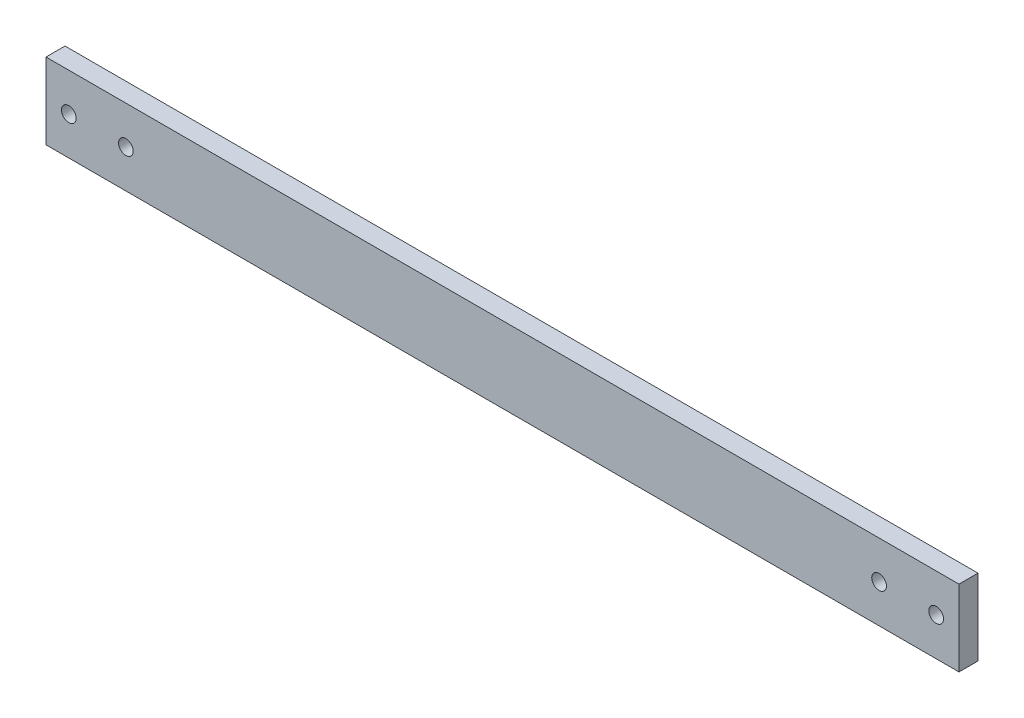
ISO-10303-21;
HEADER;
FILE_DESCRIPTION(('STEP AP214'),'2;1');
FILE_NAME('part.step','',(''),(''),'','','');
FILE_SCHEMA(('AUTOMOTIVE_DESIGN { 1 0 10303 214 1 1 1 1 }'));
ENDSEC;
DATA;
#1=APPLICATION_CONTEXT('core data for automotive mechanical design processes');
#2=APPLICATION_PROTOCOL_DEFINITION('international standard','automotive_design',2000,#1);
#3=PRODUCT_CONTEXT('',#1,'mechanical');
#4=PRODUCT('Part','Part','',(#3));
#5=PRODUCT_RELATED_PRODUCT_CATEGORY('part','',(#4));
#6=PRODUCT_DEFINITION_FORMATION('','',#4);
#7=PRODUCT_DEFINITION_CONTEXT('part definition',#1,'design');
#8=PRODUCT_DEFINITION('design','',#6,#7);
#9=PRODUCT_DEFINITION_SHAPE('','',#8);
#10=(LENGTH_UNIT() NAMED_UNIT(*) SI_UNIT(.MILLI.,.METRE.));
#11=(NAMED_UNIT(*) PLANE_ANGLE_UNIT() SI_UNIT($,.RADIAN.));
#12=(NAMED_UNIT(*) SI_UNIT($,.STERADIAN.) SOLID_ANGLE_UNIT());
#13=UNCERTAINTY_MEASURE_WITH_UNIT(LENGTH_MEASURE(1.E-05),#10,'distance_accuracy_value','');
#14=(GEOMETRIC_REPRESENTATION_CONTEXT(3) GLOBAL_UNCERTAINTY_ASSIGNED_CONTEXT((#13)) GLOBAL_UNIT_ASSIGNED_CONTEXT((#10,
#11,#12)) REPRESENTATION_CONTEXT('',''));
#15=CARTESIAN_POINT('',(0.,0.,0.));
#16=DIRECTION('',(0.,0.,1.));
#17=DIRECTION('',(1.,0.,0.));
#18=AXIS2_PLACEMENT_3D('',#15,#16,#17);
#19=CARTESIAN_POINT('',(0.,12.7,3.175));
#20=DIRECTION('',(0.999999999999999,0.,0.));
#21=DIRECTION('',(0.,1.,0.));
#22=AXIS2_PLACEMENT_3D('',#19,#20,#21);
#23=PLANE('',#22);
#24=DIRECTION('',(0.,-1.,0.));
#25=VECTOR('',#24,1.);
#26=CARTESIAN_POINT('',(0.,12.7,-3.175));
#27=LINE('',#26,#25);
#28=CARTESIAN_POINT('',(0.,12.7,-3.175));
#29=VERTEX_POINT('',#28);
#30=CARTESIAN_POINT('',(0.,-12.7,-3.175));
#31=VERTEX_POINT('',#30);
#32=EDGE_CURVE('E105',#29,#31,#27,.T.);
#33=ORIENTED_EDGE('',*,*,#32,.T.);
#34=DIRECTION('',(0.,0.,-0.999999999999999));
#35=VECTOR('',#34,1.);
#36=CARTESIAN_POINT('',(0.,-12.7,3.17499999999999));
#37=LINE('',#36,#35);
#38=CARTESIAN_POINT('',(0.,-12.7,3.17499999999999));
#39=VERTEX_POINT('',#38);
#40=EDGE_CURVE('E11',#39,#31,#37,.T.);
#41=ORIENTED_EDGE('',*,*,#40,.F.);
#42=DIRECTION('',(0.,-1.,0.));
#43=VECTOR('',#42,1.);
#44=CARTESIAN_POINT('',(0.,12.7,3.175));
#45=LINE('',#44,#43);
#46=CARTESIAN_POINT('',(0.,12.7,3.175));
#47=VERTEX_POINT('',#46);
#48=EDGE_CURVE('E93',#47,#39,#45,.T.);
#49=ORIENTED_EDGE('',*,*,#48,.F.);
#50=DIRECTION('',(0.,0.,-0.999999999999999));
#51=VECTOR('',#50,1.);
#52=CARTESIAN_POINT('',(0.,12.7,3.175));
#53=LINE('',#52,#51);
#54=EDGE_CURVE('E101',#47,#29,#53,.T.);
#55=ORIENTED_EDGE('',*,*,#54,.T.);
#56=EDGE_LOOP('',(#33,#41,#49,#55));
#57=FACE_BOUND('',#56,.T.);
#58=ADVANCED_FACE('F42',(#57),#23,.F.);
#59=CARTESIAN_POINT('',(0.,-12.7,3.17499999999999));
#60=DIRECTION('',(0.,1.,0.));
#61=DIRECTION('',(-0.999999999999999,0.,0.));
#62=AXIS2_PLACEMENT_3D('',#59,#60,#61);
#63=PLANE('',#62);
#64=DIRECTION('',(0.999999999999999,0.,0.));
#65=VECTOR('',#64,1.);
#66=CARTESIAN_POINT('',(0.,-12.7,-3.175));
#67=LINE('',#66,#65);
#68=CARTESIAN_POINT('',(304.8,-12.6999999999989,-3.17499999999998));
#69=VERTEX_POINT('',#68);
#70=EDGE_CURVE('E97',#31,#69,#67,.T.);
#71=ORIENTED_EDGE('',*,*,#70,.T.);
#72=DIRECTION('',(0.,0.,-0.999999999999999));
#73=VECTOR('',#72,1.);
#74=CARTESIAN_POINT('',(304.8,-12.6999999999989,3.17500000000001));
#75=LINE('',#74,#73);
#76=CARTESIAN_POINT('',(304.8,-12.6999999999989,3.17500000000001));
#77=VERTEX_POINT('',#76);
#78=EDGE_CURVE('E50',#77,#69,#75,.T.);
#79=ORIENTED_EDGE('',*,*,#78,.F.);
#80=DIRECTION('',(0.999999999999999,0.,0.));
#81=VECTOR('',#80,1.);
#82=CARTESIAN_POINT('',(0.,-12.7,3.17499999999999));
#83=LINE('',#82,#81);
#84=EDGE_CURVE('E88',#39,#77,#83,.T.);
#85=ORIENTED_EDGE('',*,*,#84,.F.);
#86=ORIENTED_EDGE('',*,*,#40,.T.);
#87=EDGE_LOOP('',(#71,#79,#85,#86));
#88=FACE_BOUND('',#87,.T.);
#89=ADVANCED_FACE('F96',(#88),#63,.F.);
#90=CARTESIAN_POINT('',(304.8,12.7000000000008,3.17500000000001));
#91=DIRECTION('',(-0.999999999999999,0.,0.));
#92=DIRECTION('',(0.,0.,0.999999999999999));
#93=AXIS2_PLACEMENT_3D('',#90,#91,#92);
#94=PLANE('',#93);
#95=DIRECTION('',(0.,1.,0.));
#96=VECTOR('',#95,1.);
#97=CARTESIAN_POINT('',(304.8,12.7000000000008,-3.17499999999998));
#98=LINE('',#97,#96);
#99=CARTESIAN_POINT('',(304.8,12.7000000000008,-3.17499999999998));
#100=VERTEX_POINT('',#99);
#101=EDGE_CURVE('E75',#69,#100,#98,.T.);
#102=ORIENTED_EDGE('',*,*,#101,.T.);
#103=DIRECTION('',(0.,0.,-0.999999999999999));
#104=VECTOR('',#103,1.);
#105=CARTESIAN_POINT('',(304.8,12.7000000000008,3.17500000000001));
#106=LINE('',#105,#104);
#107=CARTESIAN_POINT('',(304.8,12.7000000000008,3.17500000000001));
#108=VERTEX_POINT('',#107);
#109=EDGE_CURVE('E98',#108,#100,#106,.T.);
#110=ORIENTED_EDGE('',*,*,#109,.F.);
#111=DIRECTION('',(0.,1.,0.));
#112=VECTOR('',#111,1.);
#113=CARTESIAN_POINT('',(304.8,12.7000000000008,3.17500000000001));
#114=LINE('',#113,#112);
#115=EDGE_CURVE('E91',#77,#108,#114,.T.);
#116=ORIENTED_EDGE('',*,*,#115,.F.);
#117=ORIENTED_EDGE('',*,*,#78,.T.);
#118=EDGE_LOOP('',(#102,#110,#116,#117));
#119=FACE_BOUND('',#118,.T.);
#120=ADVANCED_FACE('F99',(#119),#94,.F.);
#121=CARTESIAN_POINT('',(0.,12.7,3.175));
#122=DIRECTION('',(0.,-1.,0.));
#123=DIRECTION('',(0.,0.,-0.999999999999999));
#124=AXIS2_PLACEMENT_3D('',#121,#122,#123);
#125=PLANE('',#124);
#126=DIRECTION('',(-0.999999999999999,0.,0.));
#127=VECTOR('',#126,1.);
#128=CARTESIAN_POINT('',(0.,12.7,-3.175));
#129=LINE('',#128,#127);
#130=EDGE_CURVE('E81',#100,#29,#129,.T.);
#131=ORIENTED_EDGE('',*,*,#130,.T.);
#132=ORIENTED_EDGE('',*,*,#54,.F.);
#133=DIRECTION('',(-0.999999999999999,0.,0.));
#134=VECTOR('',#133,1.);
#135=CARTESIAN_POINT('',(0.,12.7,3.175));
#136=LINE('',#135,#134);
#137=EDGE_CURVE('E58',#108,#47,#136,.T.);
#138=ORIENTED_EDGE('',*,*,#137,.F.);
#139=ORIENTED_EDGE('',*,*,#109,.T.);
#140=EDGE_LOOP('',(#131,#132,#138,#139));
#141=FACE_BOUND('',#140,.T.);
#142=ADVANCED_FACE('F114',(#141),#125,.F.);
#143=CARTESIAN_POINT('',(0.,0.,3.175));
#144=DIRECTION('',(0.,0.,0.999999999999999));
#145=DIRECTION('',(0.999999999999999,0.,0.));
#146=AXIS2_PLACEMENT_3D('',#143,#144,#145);
#147=PLANE('',#146);
#148=CARTESIAN_POINT('',(7.61999999999999,0.,3.175));
#149=DIRECTION('',(0.,0.,0.999999999999999));
#150=DIRECTION('',(0.999999999999999,0.,0.));
#151=AXIS2_PLACEMENT_3D('',#148,#149,#150);
#152=CIRCLE('',#151,2.45744999999999);
#153=CARTESIAN_POINT('',(10.07745,0.,3.175));
#154=VERTEX_POINT('',#153);
#155=EDGE_CURVE('E140',#154,#154,#152,.T.);
#156=ORIENTED_EDGE('',*,*,#155,.F.);
#157=EDGE_LOOP('',(#156));
#158=FACE_BOUND('',#157,.T.);
#159=CARTESIAN_POINT('',(26.67,0.,3.17500000000001));
#160=DIRECTION('',(0.,0.,0.999999999999999));
#161=DIRECTION('',(0.999999999999999,0.,0.));
#162=AXIS2_PLACEMENT_3D('',#159,#160,#161);
#163=CIRCLE('',#162,2.45744999999999);
#164=CARTESIAN_POINT('',(29.1274499999999,0.,3.17500000000001));
#165=VERTEX_POINT('',#164);
#166=EDGE_CURVE('E134',#165,#165,#163,.T.);
#167=ORIENTED_EDGE('',*,*,#166,.F.);
#168=EDGE_LOOP('',(#167));
#169=FACE_BOUND('',#168,.T.);
#170=CARTESIAN_POINT('',(278.13,8.88178419700125E-13,3.17500000000004));
#171=DIRECTION('',(0.,0.,0.999999999999999));
#172=DIRECTION('',(0.999999999999999,0.,0.));
#173=AXIS2_PLACEMENT_3D('',#170,#171,#172);
#174=CIRCLE('',#173,2.45744999999997);
#175=CARTESIAN_POINT('',(280.58745,8.88178419700125E-13,3.17500000000004));
#176=VERTEX_POINT('',#175);
#177=EDGE_CURVE('E128',#176,#176,#174,.T.);
#178=ORIENTED_EDGE('',*,*,#177,.F.);
#179=EDGE_LOOP('',(#178));
#180=FACE_BOUND('',#179,.T.);
#181=CARTESIAN_POINT('',(297.18,8.88178419700125E-13,3.17500000000001));
#182=DIRECTION('',(0.,0.,0.999999999999999));
#183=DIRECTION('',(0.999999999999999,0.,0.));
#184=AXIS2_PLACEMENT_3D('',#181,#182,#183);
#185=CIRCLE('',#184,2.45744999999997);
#186=CARTESIAN_POINT('',(299.63745,8.88178419700125E-13,3.17500000000001));
#187=VERTEX_POINT('',#186);
#188=EDGE_CURVE('E122',#187,#187,#185,.T.);
#189=ORIENTED_EDGE('',*,*,#188,.F.);
#190=EDGE_LOOP('',(#189));
#191=FACE_BOUND('',#190,.T.);
#192=ORIENTED_EDGE('',*,*,#48,.T.);
#193=ORIENTED_EDGE('',*,*,#84,.T.);
#194=ORIENTED_EDGE('',*,*,#115,.T.);
#195=ORIENTED_EDGE('',*,*,#137,.T.);
#196=EDGE_LOOP('',(#192,#193,#194,#195));
#197=FACE_BOUND('',#196,.T.);
#198=ADVANCED_FACE('F89',(#158,#169,#180,#191,#197),#147,.T.);
#199=CARTESIAN_POINT('',(0.,0.,-3.175));
#200=DIRECTION('',(0.,0.,0.999999999999999));
#201=DIRECTION('',(0.999999999999999,0.,0.));
#202=AXIS2_PLACEMENT_3D('',#199,#200,#201);
#203=PLANE('',#202);
#204=CARTESIAN_POINT('',(7.61999999999999,0.,-3.175));
#205=DIRECTION('',(0.,0.,0.999999999999999));
#206=DIRECTION('',(0.999999999999999,0.,0.));
#207=AXIS2_PLACEMENT_3D('',#204,#205,#206);
#208=CIRCLE('',#207,2.45744999999999);
#209=CARTESIAN_POINT('',(10.07745,0.,-3.175));
#210=VERTEX_POINT('',#209);
#211=EDGE_CURVE('E137',#210,#210,#208,.T.);
#212=ORIENTED_EDGE('',*,*,#211,.T.);
#213=EDGE_LOOP('',(#212));
#214=FACE_BOUND('',#213,.T.);
#215=CARTESIAN_POINT('',(26.6699999999999,0.,-3.17499999999999));
#216=DIRECTION('',(0.,0.,0.999999999999999));
#217=DIRECTION('',(0.999999999999999,0.,0.));
#218=AXIS2_PLACEMENT_3D('',#215,#216,#217);
#219=CIRCLE('',#218,2.45744999999999);
#220=CARTESIAN_POINT('',(29.1274499999999,0.,-3.17499999999999));
#221=VERTEX_POINT('',#220);
#222=EDGE_CURVE('E131',#221,#221,#219,.T.);
#223=ORIENTED_EDGE('',*,*,#222,.T.);
#224=EDGE_LOOP('',(#223));
#225=FACE_BOUND('',#224,.T.);
#226=CARTESIAN_POINT('',(278.13,8.88178419700125E-13,-3.17499999999984));
#227=DIRECTION('',(0.,0.,0.999999999999999));
#228=DIRECTION('',(0.999999999999999,0.,0.));
#229=AXIS2_PLACEMENT_3D('',#226,#227,#228);
#230=CIRCLE('',#229,2.45744999999997);
#231=CARTESIAN_POINT('',(280.58745,8.88178419700125E-13,-3.17499999999984));
#232=VERTEX_POINT('',#231);
#233=EDGE_CURVE('E125',#232,#232,#230,.T.);
#234=ORIENTED_EDGE('',*,*,#233,.T.);
#235=EDGE_LOOP('',(#234));
#236=FACE_BOUND('',#235,.T.);
#237=CARTESIAN_POINT('',(297.18,8.88178419700125E-13,-3.17500000000003));
#238=DIRECTION('',(0.,0.,0.999999999999999));
#239=DIRECTION('',(0.999999999999999,0.,0.));
#240=AXIS2_PLACEMENT_3D('',#237,#238,#239);
#241=CIRCLE('',#240,2.45744999999997);
#242=CARTESIAN_POINT('',(299.63745,8.88178419700125E-13,-3.17500000000003));
#243=VERTEX_POINT('',#242);
#244=EDGE_CURVE('E108',#243,#243,#241,.T.);
#245=ORIENTED_EDGE('',*,*,#244,.T.);
#246=EDGE_LOOP('',(#245));
#247=FACE_BOUND('',#246,.T.);
#248=ORIENTED_EDGE('',*,*,#32,.F.);
#249=ORIENTED_EDGE('',*,*,#130,.F.);
#250=ORIENTED_EDGE('',*,*,#101,.F.);
#251=ORIENTED_EDGE('',*,*,#70,.F.);
#252=EDGE_LOOP('',(#248,#249,#250,#251));
#253=FACE_BOUND('',#252,.T.);
#254=ADVANCED_FACE('F117',(#214,#225,#236,#247,#253),#203,.F.);
#255=CARTESIAN_POINT('',(297.18,8.88178419700125E-13,3.17500000000001));
#256=DIRECTION('',(0.,0.,0.999999999999999));
#257=DIRECTION('',(0.999999999999999,0.,0.));
#258=AXIS2_PLACEMENT_3D('',#255,#256,#257);
#259=CYLINDRICAL_SURFACE('',#258,2.45744999999997);
#260=ORIENTED_EDGE('',*,*,#188,.T.);
#261=EDGE_LOOP('',(#260));
#262=FACE_BOUND('',#261,.T.);
#263=ORIENTED_EDGE('',*,*,#244,.F.);
#264=EDGE_LOOP('',(#263));
#265=FACE_BOUND('',#264,.T.);
#266=ADVANCED_FACE('F156',(#262,#265),#259,.F.);
#267=CARTESIAN_POINT('',(278.13,8.88178419700125E-13,3.17500000000004));
#268=DIRECTION('',(0.,0.,0.999999999999999));
#269=DIRECTION('',(0.999999999999999,0.,0.));
#270=AXIS2_PLACEMENT_3D('',#267,#268,#269);
#271=CYLINDRICAL_SURFACE('',#270,2.45744999999997);
#272=ORIENTED_EDGE('',*,*,#177,.T.);
#273=EDGE_LOOP('',(#272));
#274=FACE_BOUND('',#273,.T.);
#275=ORIENTED_EDGE('',*,*,#233,.F.);
#276=EDGE_LOOP('',(#275));
#277=FACE_BOUND('',#276,.T.);
#278=ADVANCED_FACE('F159',(#274,#277),#271,.F.);
#279=CARTESIAN_POINT('',(26.67,0.,3.17500000000001));
#280=DIRECTION('',(0.,0.,0.999999999999999));
#281=DIRECTION('',(0.999999999999999,0.,0.));
#282=AXIS2_PLACEMENT_3D('',#279,#280,#281);
#283=CYLINDRICAL_SURFACE('',#282,2.45744999999999);
#284=ORIENTED_EDGE('',*,*,#166,.T.);
#285=EDGE_LOOP('',(#284));
#286=FACE_BOUND('',#285,.T.);
#287=ORIENTED_EDGE('',*,*,#222,.F.);
#288=EDGE_LOOP('',(#287));
#289=FACE_BOUND('',#288,.T.);
#290=ADVANCED_FACE('F200',(#286,#289),#283,.F.);
#291=CARTESIAN_POINT('',(7.61999999999999,0.,3.175));
#292=DIRECTION('',(0.,0.,0.999999999999999));
#293=DIRECTION('',(0.999999999999999,0.,0.));
#294=AXIS2_PLACEMENT_3D('',#291,#292,#293);
#295=CYLINDRICAL_SURFACE('',#294,2.45744999999999);
#296=ORIENTED_EDGE('',*,*,#155,.T.);
#297=EDGE_LOOP('',(#296));
#298=FACE_BOUND('',#297,.T.);
#299=ORIENTED_EDGE('',*,*,#211,.F.);
#300=EDGE_LOOP('',(#299));
#301=FACE_BOUND('',#300,.T.);
#302=ADVANCED_FACE('F144',(#298,#301),#295,.F.);
#303=CLOSED_SHELL('',(#58,#89,#120,#142,#198,#254,#266,#278,#290,#302));
#304=MANIFOLD_SOLID_BREP('B2',#303);
#305=ADVANCED_BREP_SHAPE_REPRESENTATION('',(#18,#304),#14);
#306=SHAPE_DEFINITION_REPRESENTATION(#9,#305);
ENDSEC;
END-ISO-10303-21;
